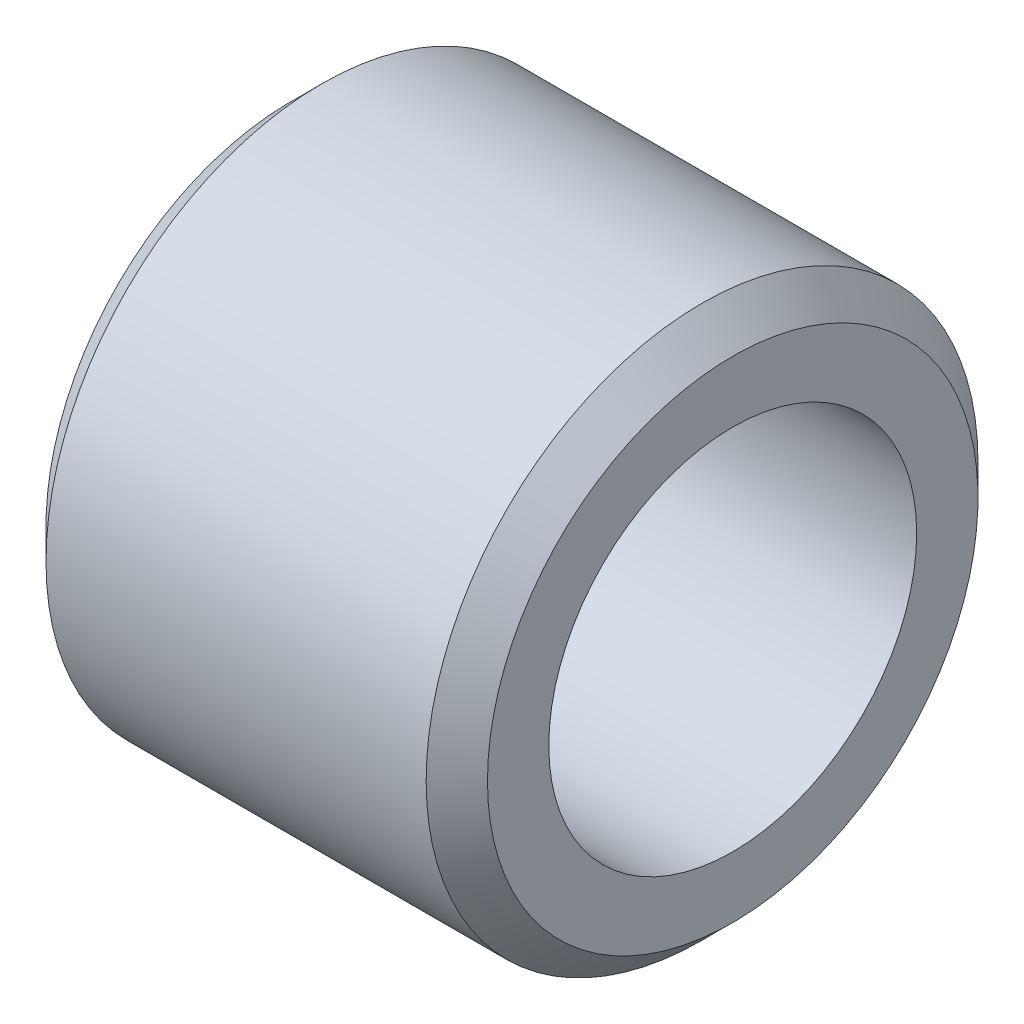
ISO-10303-21;
HEADER;
FILE_DESCRIPTION(('STEP AP214'),'2;1');
FILE_NAME('part.step','',(''),(''),'','','');
FILE_SCHEMA(('AUTOMOTIVE_DESIGN { 1 0 10303 214 1 1 1 1 }'));
ENDSEC;
DATA;
#1=APPLICATION_CONTEXT('core data for automotive mechanical design processes');
#2=APPLICATION_PROTOCOL_DEFINITION('international standard','automotive_design',2000,#1);
#3=PRODUCT_CONTEXT('',#1,'mechanical');
#4=PRODUCT('Part','Part','',(#3));
#5=PRODUCT_RELATED_PRODUCT_CATEGORY('part','',(#4));
#6=PRODUCT_DEFINITION_FORMATION('','',#4);
#7=PRODUCT_DEFINITION_CONTEXT('part definition',#1,'design');
#8=PRODUCT_DEFINITION('design','',#6,#7);
#9=PRODUCT_DEFINITION_SHAPE('','',#8);
#10=(LENGTH_UNIT() NAMED_UNIT(*) SI_UNIT(.MILLI.,.METRE.));
#11=(NAMED_UNIT(*) PLANE_ANGLE_UNIT() SI_UNIT($,.RADIAN.));
#12=(NAMED_UNIT(*) SI_UNIT($,.STERADIAN.) SOLID_ANGLE_UNIT());
#13=UNCERTAINTY_MEASURE_WITH_UNIT(LENGTH_MEASURE(1.E-05),#10,'distance_accuracy_value','');
#14=(GEOMETRIC_REPRESENTATION_CONTEXT(3) GLOBAL_UNCERTAINTY_ASSIGNED_CONTEXT((#13)) GLOBAL_UNIT_ASSIGNED_CONTEXT((#10,
#11,#12)) REPRESENTATION_CONTEXT('',''));
#15=CARTESIAN_POINT('',(0.,0.,0.));
#16=DIRECTION('',(0.,0.,1.));
#17=DIRECTION('',(1.,0.,0.));
#18=AXIS2_PLACEMENT_3D('',#15,#16,#17);
#19=CARTESIAN_POINT('',(7.2,4.5,0.));
#20=DIRECTION('',(-1.,0.,0.));
#21=DIRECTION('',(0.,0.,1.));
#22=AXIS2_PLACEMENT_3D('',#19,#20,#21);
#23=PLANE('',#22);
#24=CARTESIAN_POINT('',(7.2,0.,0.));
#25=DIRECTION('',(-1.,0.,0.));
#26=DIRECTION('',(0.,0.,1.));
#27=AXIS2_PLACEMENT_3D('',#24,#25,#26);
#28=CIRCLE('',#27,3.99999999999999);
#29=CARTESIAN_POINT('',(7.2,0.,3.99999999999999));
#30=VERTEX_POINT('',#29);
#31=EDGE_CURVE('E10',#30,#30,#28,.F.);
#32=ORIENTED_EDGE('',*,*,#31,.T.);
#33=EDGE_LOOP('',(#32));
#34=FACE_BOUND('',#33,.T.);
#35=CARTESIAN_POINT('',(7.2,0.,0.));
#36=DIRECTION('',(-1.,0.,0.));
#37=DIRECTION('',(0.,0.,1.));
#38=AXIS2_PLACEMENT_3D('',#35,#36,#37);
#39=CIRCLE('',#38,3.);
#40=CARTESIAN_POINT('',(7.2,0.,3.));
#41=VERTEX_POINT('',#40);
#42=EDGE_CURVE('E51',#41,#41,#39,.T.);
#43=ORIENTED_EDGE('',*,*,#42,.T.);
#44=EDGE_LOOP('',(#43));
#45=FACE_BOUND('',#44,.T.);
#46=ADVANCED_FACE('F31',(#34,#45),#23,.F.);
#47=CARTESIAN_POINT('',(0.,0.,0.));
#48=DIRECTION('',(-1.,0.,0.));
#49=DIRECTION('',(0.,0.,1.));
#50=AXIS2_PLACEMENT_3D('',#47,#48,#49);
#51=CYLINDRICAL_SURFACE('',#50,3.);
#52=ORIENTED_EDGE('',*,*,#42,.F.);
#53=EDGE_LOOP('',(#52));
#54=FACE_BOUND('',#53,.T.);
#55=CARTESIAN_POINT('',(0.,0.,0.));
#56=DIRECTION('',(-1.,0.,0.));
#57=DIRECTION('',(0.,0.,1.));
#58=AXIS2_PLACEMENT_3D('',#55,#56,#57);
#59=CIRCLE('',#58,3.);
#60=CARTESIAN_POINT('',(0.,0.,3.));
#61=VERTEX_POINT('',#60);
#62=EDGE_CURVE('E54',#61,#61,#59,.T.);
#63=ORIENTED_EDGE('',*,*,#62,.T.);
#64=EDGE_LOOP('',(#63));
#65=FACE_BOUND('',#64,.T.);
#66=ADVANCED_FACE('F58',(#54,#65),#51,.F.);
#67=CARTESIAN_POINT('',(0.,3.,0.));
#68=DIRECTION('',(1.,0.,0.));
#69=DIRECTION('',(0.,0.,-1.));
#70=AXIS2_PLACEMENT_3D('',#67,#68,#69);
#71=PLANE('',#70);
#72=CARTESIAN_POINT('',(0.,0.,0.));
#73=DIRECTION('',(1.,0.,0.));
#74=DIRECTION('',(0.,0.,-1.));
#75=AXIS2_PLACEMENT_3D('',#72,#73,#74);
#76=CIRCLE('',#75,4.);
#77=CARTESIAN_POINT('',(0.,0.,-4.));
#78=VERTEX_POINT('',#77);
#79=EDGE_CURVE('E46',#78,#78,#76,.F.);
#80=ORIENTED_EDGE('',*,*,#79,.T.);
#81=EDGE_LOOP('',(#80));
#82=FACE_BOUND('',#81,.T.);
#83=ORIENTED_EDGE('',*,*,#62,.F.);
#84=EDGE_LOOP('',(#83));
#85=FACE_BOUND('',#84,.T.);
#86=ADVANCED_FACE('F60',(#82,#85),#71,.F.);
#87=CARTESIAN_POINT('',(0.,0.,0.));
#88=DIRECTION('',(-1.,0.,0.));
#89=DIRECTION('',(0.,0.,1.));
#90=AXIS2_PLACEMENT_3D('',#87,#88,#89);
#91=CYLINDRICAL_SURFACE('',#90,4.5);
#92=CARTESIAN_POINT('',(0.500000000000001,0.,0.));
#93=DIRECTION('',(1.,0.,0.));
#94=DIRECTION('',(0.,0.,-1.));
#95=AXIS2_PLACEMENT_3D('',#92,#93,#94);
#96=CIRCLE('',#95,4.5);
#97=CARTESIAN_POINT('',(0.500000000000001,0.,-4.5));
#98=VERTEX_POINT('',#97);
#99=EDGE_CURVE('E38',#98,#98,#96,.T.);
#100=ORIENTED_EDGE('',*,*,#99,.T.);
#101=EDGE_LOOP('',(#100));
#102=FACE_BOUND('',#101,.T.);
#103=CARTESIAN_POINT('',(6.7,0.,0.));
#104=DIRECTION('',(-1.,0.,0.));
#105=DIRECTION('',(0.,0.,1.));
#106=AXIS2_PLACEMENT_3D('',#103,#104,#105);
#107=CIRCLE('',#106,4.5);
#108=CARTESIAN_POINT('',(6.7,0.,4.5));
#109=VERTEX_POINT('',#108);
#110=EDGE_CURVE('E42',#109,#109,#107,.T.);
#111=ORIENTED_EDGE('',*,*,#110,.T.);
#112=EDGE_LOOP('',(#111));
#113=FACE_BOUND('',#112,.T.);
#114=ADVANCED_FACE('F62',(#102,#113),#91,.T.);
#115=CARTESIAN_POINT('',(0.,0.,0.));
#116=DIRECTION('',(1.,0.,0.));
#117=DIRECTION('',(0.,0.,-1.));
#118=AXIS2_PLACEMENT_3D('',#115,#116,#117);
#119=CONICAL_SURFACE('',#118,4.,0.785398163397447);
#120=ORIENTED_EDGE('',*,*,#99,.F.);
#121=EDGE_LOOP('',(#120));
#122=FACE_BOUND('',#121,.T.);
#123=ORIENTED_EDGE('',*,*,#79,.F.);
#124=EDGE_LOOP('',(#123));
#125=FACE_BOUND('',#124,.T.);
#126=ADVANCED_FACE('F69',(#122,#125),#119,.T.);
#127=CARTESIAN_POINT('',(6.7,0.,0.));
#128=DIRECTION('',(-1.,0.,0.));
#129=DIRECTION('',(0.,0.,1.));
#130=AXIS2_PLACEMENT_3D('',#127,#128,#129);
#131=CONICAL_SURFACE('',#130,4.5,0.78539816339745);
#132=ORIENTED_EDGE('',*,*,#31,.F.);
#133=EDGE_LOOP('',(#132));
#134=FACE_BOUND('',#133,.T.);
#135=ORIENTED_EDGE('',*,*,#110,.F.);
#136=EDGE_LOOP('',(#135));
#137=FACE_BOUND('',#136,.T.);
#138=ADVANCED_FACE('F33',(#134,#137),#131,.T.);
#139=CLOSED_SHELL('',(#46,#66,#86,#114,#126,#138));
#140=MANIFOLD_SOLID_BREP('B2',#139);
#141=ADVANCED_BREP_SHAPE_REPRESENTATION('',(#18,#140),#14);
#142=SHAPE_DEFINITION_REPRESENTATION(#9,#141);
ENDSEC;
END-ISO-10303-21;
